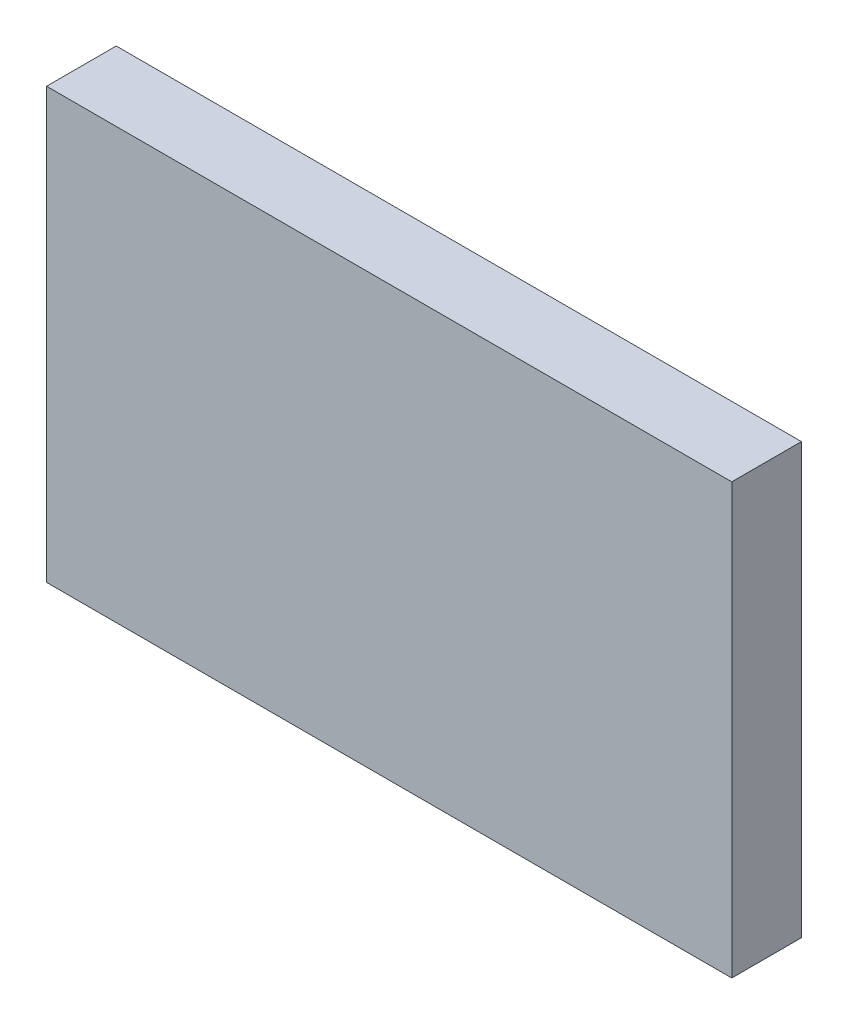
ISO-10303-21;
HEADER;
FILE_DESCRIPTION(('STEP AP214'),'2;1');
FILE_NAME('part.step','',(''),(''),'','','');
FILE_SCHEMA(('AUTOMOTIVE_DESIGN { 1 0 10303 214 1 1 1 1 }'));
ENDSEC;
DATA;
#1=APPLICATION_CONTEXT('core data for automotive mechanical design processes');
#2=APPLICATION_PROTOCOL_DEFINITION('international standard','automotive_design',2000,#1);
#3=PRODUCT_CONTEXT('',#1,'mechanical');
#4=PRODUCT('Part','Part','',(#3));
#5=PRODUCT_RELATED_PRODUCT_CATEGORY('part','',(#4));
#6=PRODUCT_DEFINITION_FORMATION('','',#4);
#7=PRODUCT_DEFINITION_CONTEXT('part definition',#1,'design');
#8=PRODUCT_DEFINITION('design','',#6,#7);
#9=PRODUCT_DEFINITION_SHAPE('','',#8);
#10=(LENGTH_UNIT() NAMED_UNIT(*) SI_UNIT(.MILLI.,.METRE.));
#11=(NAMED_UNIT(*) PLANE_ANGLE_UNIT() SI_UNIT($,.RADIAN.));
#12=(NAMED_UNIT(*) SI_UNIT($,.STERADIAN.) SOLID_ANGLE_UNIT());
#13=UNCERTAINTY_MEASURE_WITH_UNIT(LENGTH_MEASURE(1.E-05),#10,'distance_accuracy_value','');
#14=(GEOMETRIC_REPRESENTATION_CONTEXT(3) GLOBAL_UNCERTAINTY_ASSIGNED_CONTEXT((#13)) GLOBAL_UNIT_ASSIGNED_CONTEXT((#10,
#11,#12)) REPRESENTATION_CONTEXT('',''));
#15=CARTESIAN_POINT('',(0.,0.,0.));
#16=DIRECTION('',(0.,0.,1.));
#17=DIRECTION('',(1.,0.,0.));
#18=AXIS2_PLACEMENT_3D('',#15,#16,#17);
#19=CARTESIAN_POINT('',(-29.5,18.5,6.));
#20=DIRECTION('',(1.,0.,0.));
#21=DIRECTION('',(0.,0.,-1.));
#22=AXIS2_PLACEMENT_3D('',#19,#20,#21);
#23=PLANE('',#22);
#24=DIRECTION('',(0.,-1.,0.));
#25=VECTOR('',#24,1.);
#26=CARTESIAN_POINT('',(-29.5,18.5,0.));
#27=LINE('',#26,#25);
#28=CARTESIAN_POINT('',(-29.5,18.5,0.));
#29=VERTEX_POINT('',#28);
#30=CARTESIAN_POINT('',(-29.5,-18.5,0.));
#31=VERTEX_POINT('',#30);
#32=EDGE_CURVE('E97',#29,#31,#27,.T.);
#33=ORIENTED_EDGE('',*,*,#32,.T.);
#34=DIRECTION('',(0.,0.,-1.));
#35=VECTOR('',#34,1.);
#36=CARTESIAN_POINT('',(-29.5,-18.5,6.));
#37=LINE('',#36,#35);
#38=CARTESIAN_POINT('',(-29.5,-18.5,6.));
#39=VERTEX_POINT('',#38);
#40=EDGE_CURVE('E11',#39,#31,#37,.T.);
#41=ORIENTED_EDGE('',*,*,#40,.F.);
#42=DIRECTION('',(0.,-1.,0.));
#43=VECTOR('',#42,1.);
#44=CARTESIAN_POINT('',(-29.5,18.5,6.));
#45=LINE('',#44,#43);
#46=CARTESIAN_POINT('',(-29.5,18.5,6.));
#47=VERTEX_POINT('',#46);
#48=EDGE_CURVE('E85',#47,#39,#45,.T.);
#49=ORIENTED_EDGE('',*,*,#48,.F.);
#50=DIRECTION('',(0.,0.,-1.));
#51=VECTOR('',#50,1.);
#52=CARTESIAN_POINT('',(-29.5,18.5,6.));
#53=LINE('',#52,#51);
#54=EDGE_CURVE('E93',#47,#29,#53,.T.);
#55=ORIENTED_EDGE('',*,*,#54,.T.);
#56=EDGE_LOOP('',(#33,#41,#49,#55));
#57=FACE_BOUND('',#56,.T.);
#58=ADVANCED_FACE('F34',(#57),#23,.F.);
#59=CARTESIAN_POINT('',(29.5,-18.5,6.));
#60=DIRECTION('',(0.,1.,0.));
#61=DIRECTION('',(0.,0.,1.));
#62=AXIS2_PLACEMENT_3D('',#59,#60,#61);
#63=PLANE('',#62);
#64=DIRECTION('',(1.,0.,0.));
#65=VECTOR('',#64,1.);
#66=CARTESIAN_POINT('',(29.5,-18.5,0.));
#67=LINE('',#66,#65);
#68=CARTESIAN_POINT('',(29.5,-18.5,0.));
#69=VERTEX_POINT('',#68);
#70=EDGE_CURVE('E89',#31,#69,#67,.T.);
#71=ORIENTED_EDGE('',*,*,#70,.T.);
#72=DIRECTION('',(0.,0.,-1.));
#73=VECTOR('',#72,1.);
#74=CARTESIAN_POINT('',(29.5,-18.5,6.));
#75=LINE('',#74,#73);
#76=CARTESIAN_POINT('',(29.5,-18.5,6.));
#77=VERTEX_POINT('',#76);
#78=EDGE_CURVE('E42',#77,#69,#75,.T.);
#79=ORIENTED_EDGE('',*,*,#78,.F.);
#80=DIRECTION('',(1.,0.,0.));
#81=VECTOR('',#80,1.);
#82=CARTESIAN_POINT('',(29.5,-18.5,6.));
#83=LINE('',#82,#81);
#84=EDGE_CURVE('E80',#39,#77,#83,.T.);
#85=ORIENTED_EDGE('',*,*,#84,.F.);
#86=ORIENTED_EDGE('',*,*,#40,.T.);
#87=EDGE_LOOP('',(#71,#79,#85,#86));
#88=FACE_BOUND('',#87,.T.);
#89=ADVANCED_FACE('F88',(#88),#63,.F.);
#90=CARTESIAN_POINT('',(29.5,18.5,6.));
#91=DIRECTION('',(-1.,0.,0.));
#92=DIRECTION('',(0.,0.,1.));
#93=AXIS2_PLACEMENT_3D('',#90,#91,#92);
#94=PLANE('',#93);
#95=DIRECTION('',(0.,1.,0.));
#96=VECTOR('',#95,1.);
#97=CARTESIAN_POINT('',(29.5,18.5,0.));
#98=LINE('',#97,#96);
#99=CARTESIAN_POINT('',(29.5,18.5,0.));
#100=VERTEX_POINT('',#99);
#101=EDGE_CURVE('E67',#69,#100,#98,.T.);
#102=ORIENTED_EDGE('',*,*,#101,.T.);
#103=DIRECTION('',(0.,0.,-1.));
#104=VECTOR('',#103,1.);
#105=CARTESIAN_POINT('',(29.5,18.5,6.));
#106=LINE('',#105,#104);
#107=CARTESIAN_POINT('',(29.5,18.5,6.));
#108=VERTEX_POINT('',#107);
#109=EDGE_CURVE('E90',#108,#100,#106,.T.);
#110=ORIENTED_EDGE('',*,*,#109,.F.);
#111=DIRECTION('',(0.,1.,0.));
#112=VECTOR('',#111,1.);
#113=CARTESIAN_POINT('',(29.5,18.5,6.));
#114=LINE('',#113,#112);
#115=EDGE_CURVE('E83',#77,#108,#114,.T.);
#116=ORIENTED_EDGE('',*,*,#115,.F.);
#117=ORIENTED_EDGE('',*,*,#78,.T.);
#118=EDGE_LOOP('',(#102,#110,#116,#117));
#119=FACE_BOUND('',#118,.T.);
#120=ADVANCED_FACE('F91',(#119),#94,.F.);
#121=CARTESIAN_POINT('',(29.5,18.5,6.));
#122=DIRECTION('',(0.,-1.,0.));
#123=DIRECTION('',(0.,0.,-1.));
#124=AXIS2_PLACEMENT_3D('',#121,#122,#123);
#125=PLANE('',#124);
#126=DIRECTION('',(-1.,0.,0.));
#127=VECTOR('',#126,1.);
#128=CARTESIAN_POINT('',(29.5,18.5,0.));
#129=LINE('',#128,#127);
#130=EDGE_CURVE('E73',#100,#29,#129,.T.);
#131=ORIENTED_EDGE('',*,*,#130,.T.);
#132=ORIENTED_EDGE('',*,*,#54,.F.);
#133=DIRECTION('',(-1.,0.,0.));
#134=VECTOR('',#133,1.);
#135=CARTESIAN_POINT('',(29.5,18.5,6.));
#136=LINE('',#135,#134);
#137=EDGE_CURVE('E50',#108,#47,#136,.T.);
#138=ORIENTED_EDGE('',*,*,#137,.F.);
#139=ORIENTED_EDGE('',*,*,#109,.T.);
#140=EDGE_LOOP('',(#131,#132,#138,#139));
#141=FACE_BOUND('',#140,.T.);
#142=ADVANCED_FACE('F104',(#141),#125,.F.);
#143=CARTESIAN_POINT('',(0.,0.,6.));
#144=DIRECTION('',(0.,0.,-1.));
#145=DIRECTION('',(-1.,0.,0.));
#146=AXIS2_PLACEMENT_3D('',#143,#144,#145);
#147=PLANE('',#146);
#148=ORIENTED_EDGE('',*,*,#48,.T.);
#149=ORIENTED_EDGE('',*,*,#84,.T.);
#150=ORIENTED_EDGE('',*,*,#115,.T.);
#151=ORIENTED_EDGE('',*,*,#137,.T.);
#152=EDGE_LOOP('',(#148,#149,#150,#151));
#153=FACE_BOUND('',#152,.T.);
#154=ADVANCED_FACE('F81',(#153),#147,.F.);
#155=CARTESIAN_POINT('',(0.,0.,0.));
#156=DIRECTION('',(0.,0.,-1.));
#157=DIRECTION('',(-1.,0.,0.));
#158=AXIS2_PLACEMENT_3D('',#155,#156,#157);
#159=PLANE('',#158);
#160=ORIENTED_EDGE('',*,*,#32,.F.);
#161=ORIENTED_EDGE('',*,*,#130,.F.);
#162=ORIENTED_EDGE('',*,*,#101,.F.);
#163=ORIENTED_EDGE('',*,*,#70,.F.);
#164=EDGE_LOOP('',(#160,#161,#162,#163));
#165=FACE_BOUND('',#164,.T.);
#166=ADVANCED_FACE('F107',(#165),#159,.T.);
#167=CLOSED_SHELL('',(#58,#89,#120,#142,#154,#166));
#168=MANIFOLD_SOLID_BREP('B2',#167);
#169=ADVANCED_BREP_SHAPE_REPRESENTATION('',(#18,#168),#14);
#170=SHAPE_DEFINITION_REPRESENTATION(#9,#169);
ENDSEC;
END-ISO-10303-21;
